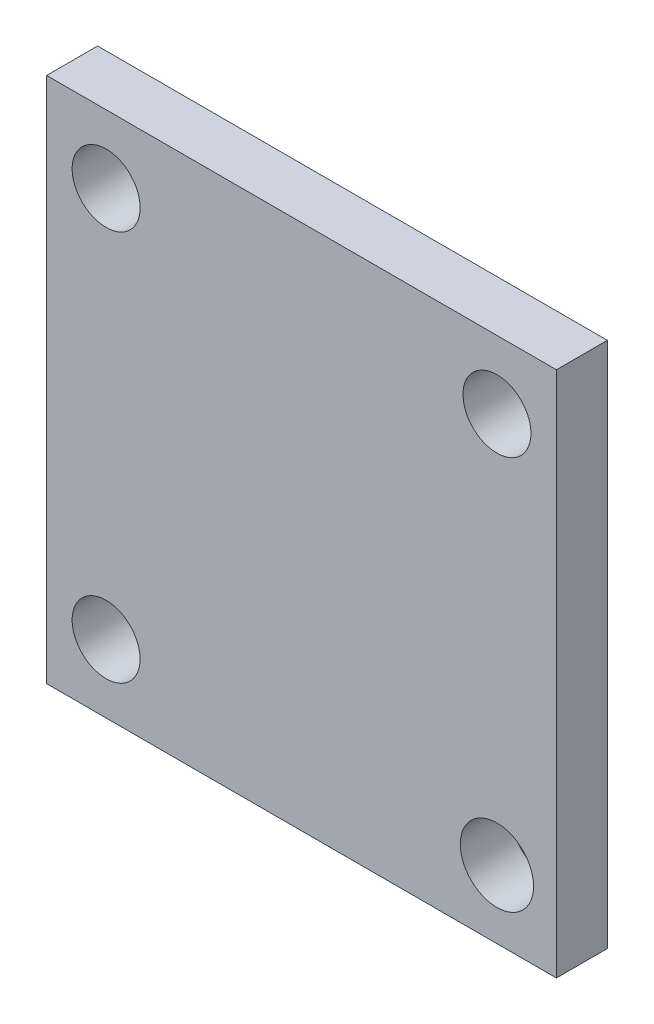
ISO-10303-21;
HEADER;
FILE_DESCRIPTION(('STEP AP214'),'2;1');
FILE_NAME('part.step','',(''),(''),'','','');
FILE_SCHEMA(('AUTOMOTIVE_DESIGN { 1 0 10303 214 1 1 1 1 }'));
ENDSEC;
DATA;
#1=APPLICATION_CONTEXT('core data for automotive mechanical design processes');
#2=APPLICATION_PROTOCOL_DEFINITION('international standard','automotive_design',2000,#1);
#3=PRODUCT_CONTEXT('',#1,'mechanical');
#4=PRODUCT('Part','Part','',(#3));
#5=PRODUCT_RELATED_PRODUCT_CATEGORY('part','',(#4));
#6=PRODUCT_DEFINITION_FORMATION('','',#4);
#7=PRODUCT_DEFINITION_CONTEXT('part definition',#1,'design');
#8=PRODUCT_DEFINITION('design','',#6,#7);
#9=PRODUCT_DEFINITION_SHAPE('','',#8);
#10=(LENGTH_UNIT() NAMED_UNIT(*) SI_UNIT(.MILLI.,.METRE.));
#11=(NAMED_UNIT(*) PLANE_ANGLE_UNIT() SI_UNIT($,.RADIAN.));
#12=(NAMED_UNIT(*) SI_UNIT($,.STERADIAN.) SOLID_ANGLE_UNIT());
#13=UNCERTAINTY_MEASURE_WITH_UNIT(LENGTH_MEASURE(1.E-05),#10,'distance_accuracy_value','');
#14=(GEOMETRIC_REPRESENTATION_CONTEXT(3) GLOBAL_UNCERTAINTY_ASSIGNED_CONTEXT((#13)) GLOBAL_UNIT_ASSIGNED_CONTEXT((#10,
#11,#12)) REPRESENTATION_CONTEXT('',''));
#15=CARTESIAN_POINT('',(0.,0.,0.));
#16=DIRECTION('',(0.,0.,1.));
#17=DIRECTION('',(1.,0.,0.));
#18=AXIS2_PLACEMENT_3D('',#15,#16,#17);
#19=CARTESIAN_POINT('',(0.,0.,3.));
#20=DIRECTION('',(0.,0.,1.));
#21=DIRECTION('',(1.,0.,0.));
#22=AXIS2_PLACEMENT_3D('',#19,#20,#21);
#23=PLANE('',#22);
#24=CARTESIAN_POINT('',(-11.501091744182,-11.4989082558181,3.));
#25=DIRECTION('',(0.,0.,1.));
#26=DIRECTION('',(1.,0.,0.));
#27=AXIS2_PLACEMENT_3D('',#24,#25,#26);
#28=CIRCLE('',#27,2.);
#29=CARTESIAN_POINT('',(-9.50109174418201,-11.4989082558181,3.));
#30=VERTEX_POINT('',#29);
#31=EDGE_CURVE('E142',#30,#30,#28,.T.);
#32=ORIENTED_EDGE('',*,*,#31,.F.);
#33=EDGE_LOOP('',(#32));
#34=FACE_BOUND('',#33,.T.);
#35=CARTESIAN_POINT('',(-11.4989082558179,11.5032752325463,3.));
#36=DIRECTION('',(0.,0.,1.));
#37=DIRECTION('',(1.,0.,0.));
#38=AXIS2_PLACEMENT_3D('',#35,#36,#37);
#39=CIRCLE('',#38,2.);
#40=CARTESIAN_POINT('',(-9.49890825581793,11.5032752325463,3.));
#41=VERTEX_POINT('',#40);
#42=EDGE_CURVE('E112',#41,#41,#39,.T.);
#43=ORIENTED_EDGE('',*,*,#42,.F.);
#44=EDGE_LOOP('',(#43));
#45=FACE_BOUND('',#44,.T.);
#46=DIRECTION('',(0.,1.,0.));
#47=VECTOR('',#46,1.);
#48=CARTESIAN_POINT('',(15.001091744182,-15.5010917441821,3.));
#49=LINE('',#48,#47);
#50=CARTESIAN_POINT('',(15.001091744182,-15.5010917441821,3.));
#51=VERTEX_POINT('',#50);
#52=CARTESIAN_POINT('',(15.001091744182,15.5010917441821,3.));
#53=VERTEX_POINT('',#52);
#54=EDGE_CURVE('E92',#51,#53,#49,.T.);
#55=ORIENTED_EDGE('',*,*,#54,.T.);
#56=DIRECTION('',(-1.,0.,0.));
#57=VECTOR('',#56,1.);
#58=CARTESIAN_POINT('',(15.001091744182,15.5010917441821,3.));
#59=LINE('',#58,#57);
#60=CARTESIAN_POINT('',(-15.001091744182,15.5010917441821,3.));
#61=VERTEX_POINT('',#60);
#62=EDGE_CURVE('E87',#53,#61,#59,.T.);
#63=ORIENTED_EDGE('',*,*,#62,.T.);
#64=DIRECTION('',(0.,-1.,0.));
#65=VECTOR('',#64,1.);
#66=CARTESIAN_POINT('',(-15.001091744182,-15.5010917441821,3.));
#67=LINE('',#66,#65);
#68=CARTESIAN_POINT('',(-15.001091744182,-15.5010917441821,3.));
#69=VERTEX_POINT('',#68);
#70=EDGE_CURVE('E90',#61,#69,#67,.T.);
#71=ORIENTED_EDGE('',*,*,#70,.T.);
#72=DIRECTION('',(1.,0.,0.));
#73=VECTOR('',#72,1.);
#74=CARTESIAN_POINT('',(15.001091744182,-15.5010917441821,3.));
#75=LINE('',#74,#73);
#76=EDGE_CURVE('E57',#69,#51,#75,.T.);
#77=ORIENTED_EDGE('',*,*,#76,.T.);
#78=EDGE_LOOP('',(#55,#63,#71,#77));
#79=FACE_BOUND('',#78,.T.);
#80=CARTESIAN_POINT('',(11.5032752325464,11.5010917441821,3.));
#81=DIRECTION('',(0.,0.,1.));
#82=DIRECTION('',(1.,0.,0.));
#83=AXIS2_PLACEMENT_3D('',#80,#81,#82);
#84=CIRCLE('',#83,2.);
#85=CARTESIAN_POINT('',(13.5032752325464,11.5010917441821,3.));
#86=VERTEX_POINT('',#85);
#87=EDGE_CURVE('E134',#86,#86,#84,.T.);
#88=ORIENTED_EDGE('',*,*,#87,.F.);
#89=EDGE_LOOP('',(#88));
#90=FACE_BOUND('',#89,.T.);
#91=CARTESIAN_POINT('',(11.5010917441823,-11.5010917441821,3.));
#92=DIRECTION('',(0.,0.,1.));
#93=DIRECTION('',(1.,0.,0.));
#94=AXIS2_PLACEMENT_3D('',#91,#92,#93);
#95=CIRCLE('',#94,2.15626689761665);
#96=CARTESIAN_POINT('',(13.657358641799,-11.5010917441821,3.));
#97=VERTEX_POINT('',#96);
#98=EDGE_CURVE('E150',#97,#97,#95,.T.);
#99=ORIENTED_EDGE('',*,*,#98,.F.);
#100=EDGE_LOOP('',(#99));
#101=FACE_BOUND('',#100,.T.);
#102=ADVANCED_FACE('F39',(#34,#45,#79,#90,#101),#23,.T.);
#103=CARTESIAN_POINT('',(0.,0.,0.));
#104=DIRECTION('',(0.,0.,1.));
#105=DIRECTION('',(1.,0.,0.));
#106=AXIS2_PLACEMENT_3D('',#103,#104,#105);
#107=PLANE('',#106);
#108=DIRECTION('',(0.,1.,0.));
#109=VECTOR('',#108,1.);
#110=CARTESIAN_POINT('',(15.001091744182,-15.5010917441821,0.));
#111=LINE('',#110,#109);
#112=CARTESIAN_POINT('',(15.001091744182,-15.5010917441821,0.));
#113=VERTEX_POINT('',#112);
#114=CARTESIAN_POINT('',(15.001091744182,15.5010917441821,0.));
#115=VERTEX_POINT('',#114);
#116=EDGE_CURVE('E108',#113,#115,#111,.T.);
#117=ORIENTED_EDGE('',*,*,#116,.F.);
#118=DIRECTION('',(1.,0.,0.));
#119=VECTOR('',#118,1.);
#120=CARTESIAN_POINT('',(15.001091744182,-15.5010917441821,0.));
#121=LINE('',#120,#119);
#122=CARTESIAN_POINT('',(-15.001091744182,-15.5010917441821,0.));
#123=VERTEX_POINT('',#122);
#124=EDGE_CURVE('E80',#123,#113,#121,.T.);
#125=ORIENTED_EDGE('',*,*,#124,.F.);
#126=DIRECTION('',(0.,-1.,0.));
#127=VECTOR('',#126,1.);
#128=CARTESIAN_POINT('',(-15.001091744182,-15.5010917441821,0.));
#129=LINE('',#128,#127);
#130=CARTESIAN_POINT('',(-15.001091744182,15.5010917441821,0.));
#131=VERTEX_POINT('',#130);
#132=EDGE_CURVE('E74',#131,#123,#129,.T.);
#133=ORIENTED_EDGE('',*,*,#132,.F.);
#134=DIRECTION('',(-1.,0.,0.));
#135=VECTOR('',#134,1.);
#136=CARTESIAN_POINT('',(15.001091744182,15.5010917441821,0.));
#137=LINE('',#136,#135);
#138=EDGE_CURVE('E97',#115,#131,#137,.T.);
#139=ORIENTED_EDGE('',*,*,#138,.F.);
#140=EDGE_LOOP('',(#117,#125,#133,#139));
#141=FACE_BOUND('',#140,.T.);
#142=CARTESIAN_POINT('',(-11.4989082558179,11.5032752325463,0.));
#143=DIRECTION('',(0.,0.,1.));
#144=DIRECTION('',(1.,0.,0.));
#145=AXIS2_PLACEMENT_3D('',#142,#143,#144);
#146=CIRCLE('',#145,2.);
#147=CARTESIAN_POINT('',(-9.49890825581793,11.5032752325463,0.));
#148=VERTEX_POINT('',#147);
#149=EDGE_CURVE('E130',#148,#148,#146,.T.);
#150=ORIENTED_EDGE('',*,*,#149,.T.);
#151=EDGE_LOOP('',(#150));
#152=FACE_BOUND('',#151,.T.);
#153=CARTESIAN_POINT('',(11.5032752325464,11.5010917441821,0.));
#154=DIRECTION('',(0.,0.,1.));
#155=DIRECTION('',(1.,0.,0.));
#156=AXIS2_PLACEMENT_3D('',#153,#154,#155);
#157=CIRCLE('',#156,2.);
#158=CARTESIAN_POINT('',(13.5032752325464,11.5010917441821,0.));
#159=VERTEX_POINT('',#158);
#160=EDGE_CURVE('E138',#159,#159,#157,.T.);
#161=ORIENTED_EDGE('',*,*,#160,.T.);
#162=EDGE_LOOP('',(#161));
#163=FACE_BOUND('',#162,.T.);
#164=CARTESIAN_POINT('',(-11.501091744182,-11.4989082558181,0.));
#165=DIRECTION('',(0.,0.,1.));
#166=DIRECTION('',(1.,0.,0.));
#167=AXIS2_PLACEMENT_3D('',#164,#165,#166);
#168=CIRCLE('',#167,2.);
#169=CARTESIAN_POINT('',(-9.50109174418201,-11.4989082558181,0.));
#170=VERTEX_POINT('',#169);
#171=EDGE_CURVE('E146',#170,#170,#168,.T.);
#172=ORIENTED_EDGE('',*,*,#171,.T.);
#173=EDGE_LOOP('',(#172));
#174=FACE_BOUND('',#173,.T.);
#175=CARTESIAN_POINT('',(11.5010917441823,-11.5010917441821,0.));
#176=DIRECTION('',(0.,0.,1.));
#177=DIRECTION('',(1.,0.,0.));
#178=AXIS2_PLACEMENT_3D('',#175,#176,#177);
#179=CIRCLE('',#178,2.15626689761665);
#180=CARTESIAN_POINT('',(13.657358641799,-11.5010917441821,0.));
#181=VERTEX_POINT('',#180);
#182=EDGE_CURVE('E154',#181,#181,#179,.T.);
#183=ORIENTED_EDGE('',*,*,#182,.T.);
#184=EDGE_LOOP('',(#183));
#185=FACE_BOUND('',#184,.T.);
#186=ADVANCED_FACE('F125',(#141,#152,#163,#174,#185),#107,.F.);
#187=CARTESIAN_POINT('',(15.001091744182,-15.5010917441821,3.));
#188=DIRECTION('',(-1.,0.,0.));
#189=DIRECTION('',(0.,0.,1.));
#190=AXIS2_PLACEMENT_3D('',#187,#188,#189);
#191=PLANE('',#190);
#192=ORIENTED_EDGE('',*,*,#116,.T.);
#193=DIRECTION('',(0.,0.,-1.));
#194=VECTOR('',#193,1.);
#195=CARTESIAN_POINT('',(15.001091744182,15.5010917441821,3.));
#196=LINE('',#195,#194);
#197=EDGE_CURVE('E11',#53,#115,#196,.T.);
#198=ORIENTED_EDGE('',*,*,#197,.F.);
#199=ORIENTED_EDGE('',*,*,#54,.F.);
#200=DIRECTION('',(0.,0.,-1.));
#201=VECTOR('',#200,1.);
#202=CARTESIAN_POINT('',(15.001091744182,-15.5010917441821,3.));
#203=LINE('',#202,#201);
#204=EDGE_CURVE('E104',#51,#113,#203,.T.);
#205=ORIENTED_EDGE('',*,*,#204,.T.);
#206=EDGE_LOOP('',(#192,#198,#199,#205));
#207=FACE_BOUND('',#206,.T.);
#208=ADVANCED_FACE('F41',(#207),#191,.F.);
#209=CARTESIAN_POINT('',(15.001091744182,15.5010917441821,3.));
#210=DIRECTION('',(0.,-1.,0.));
#211=DIRECTION('',(1.,0.,0.));
#212=AXIS2_PLACEMENT_3D('',#209,#210,#211);
#213=PLANE('',#212);
#214=ORIENTED_EDGE('',*,*,#138,.T.);
#215=DIRECTION('',(0.,0.,-1.));
#216=VECTOR('',#215,1.);
#217=CARTESIAN_POINT('',(-15.001091744182,15.5010917441821,3.));
#218=LINE('',#217,#216);
#219=EDGE_CURVE('E49',#61,#131,#218,.T.);
#220=ORIENTED_EDGE('',*,*,#219,.F.);
#221=ORIENTED_EDGE('',*,*,#62,.F.);
#222=ORIENTED_EDGE('',*,*,#197,.T.);
#223=EDGE_LOOP('',(#214,#220,#221,#222));
#224=FACE_BOUND('',#223,.T.);
#225=ADVANCED_FACE('F96',(#224),#213,.F.);
#226=CARTESIAN_POINT('',(-15.001091744182,-15.5010917441821,3.));
#227=DIRECTION('',(1.,0.,0.));
#228=DIRECTION('',(0.,0.,-1.));
#229=AXIS2_PLACEMENT_3D('',#226,#227,#228);
#230=PLANE('',#229);
#231=ORIENTED_EDGE('',*,*,#132,.T.);
#232=DIRECTION('',(0.,0.,-1.));
#233=VECTOR('',#232,1.);
#234=CARTESIAN_POINT('',(-15.001091744182,-15.5010917441821,3.));
#235=LINE('',#234,#233);
#236=EDGE_CURVE('E99',#69,#123,#235,.T.);
#237=ORIENTED_EDGE('',*,*,#236,.F.);
#238=ORIENTED_EDGE('',*,*,#70,.F.);
#239=ORIENTED_EDGE('',*,*,#219,.T.);
#240=EDGE_LOOP('',(#231,#237,#238,#239));
#241=FACE_BOUND('',#240,.T.);
#242=ADVANCED_FACE('F100',(#241),#230,.F.);
#243=CARTESIAN_POINT('',(15.001091744182,-15.5010917441821,3.));
#244=DIRECTION('',(0.,1.,0.));
#245=DIRECTION('',(-1.,0.,0.));
#246=AXIS2_PLACEMENT_3D('',#243,#244,#245);
#247=PLANE('',#246);
#248=ORIENTED_EDGE('',*,*,#124,.T.);
#249=ORIENTED_EDGE('',*,*,#204,.F.);
#250=ORIENTED_EDGE('',*,*,#76,.F.);
#251=ORIENTED_EDGE('',*,*,#236,.T.);
#252=EDGE_LOOP('',(#248,#249,#250,#251));
#253=FACE_BOUND('',#252,.T.);
#254=ADVANCED_FACE('F122',(#253),#247,.F.);
#255=CARTESIAN_POINT('',(-11.4989082558179,11.5032752325463,3.));
#256=DIRECTION('',(0.,0.,-1.));
#257=DIRECTION('',(-1.,0.,0.));
#258=AXIS2_PLACEMENT_3D('',#255,#256,#257);
#259=CYLINDRICAL_SURFACE('',#258,2.);
#260=ORIENTED_EDGE('',*,*,#42,.T.);
#261=EDGE_LOOP('',(#260));
#262=FACE_BOUND('',#261,.T.);
#263=ORIENTED_EDGE('',*,*,#149,.F.);
#264=EDGE_LOOP('',(#263));
#265=FACE_BOUND('',#264,.T.);
#266=ADVANCED_FACE('F175',(#262,#265),#259,.F.);
#267=CARTESIAN_POINT('',(11.5032752325464,11.5010917441821,3.));
#268=DIRECTION('',(0.,0.,-1.));
#269=DIRECTION('',(-1.,0.,0.));
#270=AXIS2_PLACEMENT_3D('',#267,#268,#269);
#271=CYLINDRICAL_SURFACE('',#270,2.);
#272=ORIENTED_EDGE('',*,*,#87,.T.);
#273=EDGE_LOOP('',(#272));
#274=FACE_BOUND('',#273,.T.);
#275=ORIENTED_EDGE('',*,*,#160,.F.);
#276=EDGE_LOOP('',(#275));
#277=FACE_BOUND('',#276,.T.);
#278=ADVANCED_FACE('F221',(#274,#277),#271,.F.);
#279=CARTESIAN_POINT('',(-11.501091744182,-11.4989082558181,3.));
#280=DIRECTION('',(0.,0.,-1.));
#281=DIRECTION('',(-1.,0.,0.));
#282=AXIS2_PLACEMENT_3D('',#279,#280,#281);
#283=CYLINDRICAL_SURFACE('',#282,2.);
#284=ORIENTED_EDGE('',*,*,#31,.T.);
#285=EDGE_LOOP('',(#284));
#286=FACE_BOUND('',#285,.T.);
#287=ORIENTED_EDGE('',*,*,#171,.F.);
#288=EDGE_LOOP('',(#287));
#289=FACE_BOUND('',#288,.T.);
#290=ADVANCED_FACE('F229',(#286,#289),#283,.F.);
#291=CARTESIAN_POINT('',(11.5010917441823,-11.5010917441821,3.));
#292=DIRECTION('',(0.,0.,-1.));
#293=DIRECTION('',(-1.,0.,0.));
#294=AXIS2_PLACEMENT_3D('',#291,#292,#293);
#295=CYLINDRICAL_SURFACE('',#294,2.15626689761665);
#296=ORIENTED_EDGE('',*,*,#98,.T.);
#297=EDGE_LOOP('',(#296));
#298=FACE_BOUND('',#297,.T.);
#299=ORIENTED_EDGE('',*,*,#182,.F.);
#300=EDGE_LOOP('',(#299));
#301=FACE_BOUND('',#300,.T.);
#302=ADVANCED_FACE('F162',(#298,#301),#295,.F.);
#303=CLOSED_SHELL('',(#102,#186,#208,#225,#242,#254,#266,#278,#290,#302));
#304=MANIFOLD_SOLID_BREP('B2',#303);
#305=ADVANCED_BREP_SHAPE_REPRESENTATION('',(#18,#304),#14);
#306=SHAPE_DEFINITION_REPRESENTATION(#9,#305);
ENDSEC;
END-ISO-10303-21;
